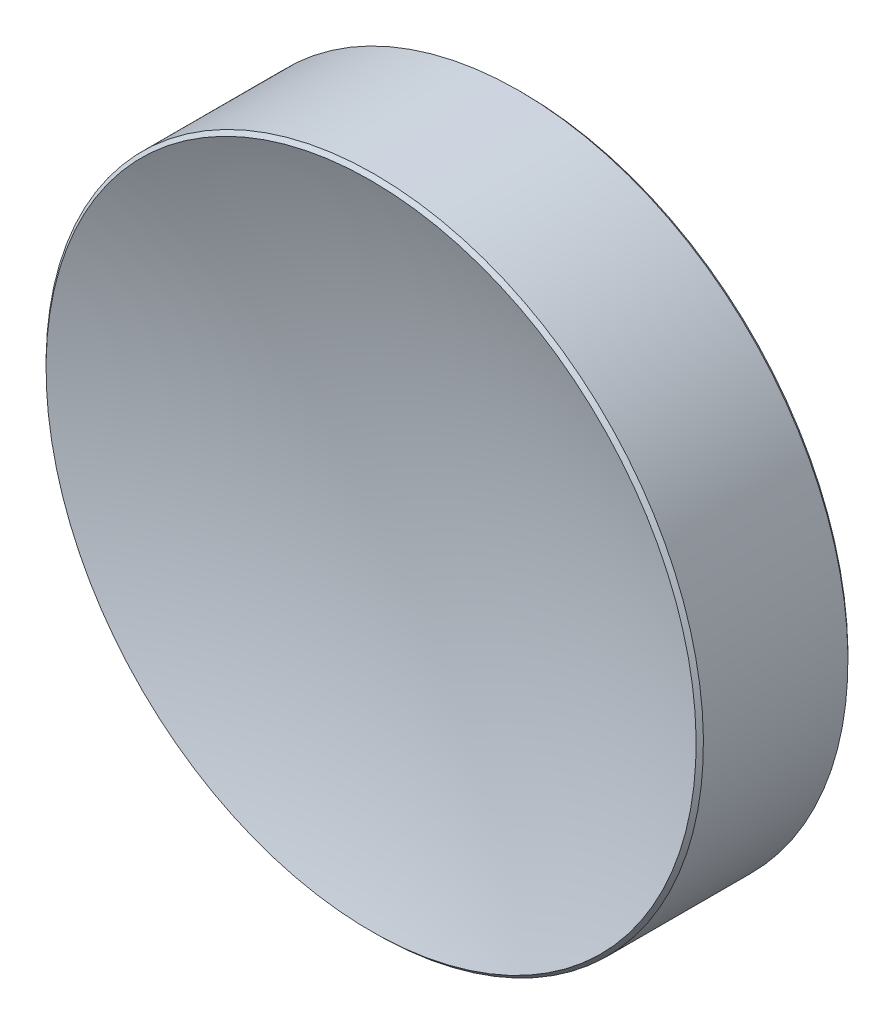
ISO-10303-21;
HEADER;
FILE_DESCRIPTION(('STEP AP214'),'2;1');
FILE_NAME('part.step','',(''),(''),'','','');
FILE_SCHEMA(('AUTOMOTIVE_DESIGN { 1 0 10303 214 1 1 1 1 }'));
ENDSEC;
DATA;
#1=APPLICATION_CONTEXT('core data for automotive mechanical design processes');
#2=APPLICATION_PROTOCOL_DEFINITION('international standard','automotive_design',2000,#1);
#3=PRODUCT_CONTEXT('',#1,'mechanical');
#4=PRODUCT('Part','Part','',(#3));
#5=PRODUCT_RELATED_PRODUCT_CATEGORY('part','',(#4));
#6=PRODUCT_DEFINITION_FORMATION('','',#4);
#7=PRODUCT_DEFINITION_CONTEXT('part definition',#1,'design');
#8=PRODUCT_DEFINITION('design','',#6,#7);
#9=PRODUCT_DEFINITION_SHAPE('','',#8);
#10=(LENGTH_UNIT() NAMED_UNIT(*) SI_UNIT(.MILLI.,.METRE.));
#11=(NAMED_UNIT(*) PLANE_ANGLE_UNIT() SI_UNIT($,.RADIAN.));
#12=(NAMED_UNIT(*) SI_UNIT($,.STERADIAN.) SOLID_ANGLE_UNIT());
#13=UNCERTAINTY_MEASURE_WITH_UNIT(LENGTH_MEASURE(1.E-05),#10,'distance_accuracy_value','');
#14=(GEOMETRIC_REPRESENTATION_CONTEXT(3) GLOBAL_UNCERTAINTY_ASSIGNED_CONTEXT((#13)) GLOBAL_UNIT_ASSIGNED_CONTEXT((#10,
#11,#12)) REPRESENTATION_CONTEXT('',''));
#15=CARTESIAN_POINT('',(0.,0.,0.));
#16=DIRECTION('',(0.,0.,1.));
#17=DIRECTION('',(1.,0.,0.));
#18=AXIS2_PLACEMENT_3D('',#15,#16,#17);
#19=CARTESIAN_POINT('',(0.,0.,36.25));
#20=DIRECTION('',(0.,0.,-1.));
#21=DIRECTION('',(0.,1.,0.));
#22=AXIS2_PLACEMENT_3D('',#19,#20,#21);
#23=SPHERICAL_SURFACE('',#22,34.5);
#24=CARTESIAN_POINT('',(0.,0.,4.11696244597427));
#25=DIRECTION('',(0.,0.,-1.));
#26=DIRECTION('',(0.,1.,0.));
#27=AXIS2_PLACEMENT_3D('',#24,#25,#26);
#28=CIRCLE('',#27,12.5585786437627);
#29=CARTESIAN_POINT('',(0.,12.5585786437627,4.11696244597428));
#30=VERTEX_POINT('',#29);
#31=EDGE_CURVE('E9',#30,#30,#28,.T.);
#32=ORIENTED_EDGE('',*,*,#31,.F.);
#33=EDGE_LOOP('',(#32));
#34=FACE_BOUND('',#33,.T.);
#35=ADVANCED_FACE('F13',(#34),#23,.F.);
#36=CARTESIAN_POINT('',(0.,0.,3.97554108973696));
#37=DIRECTION('',(0.,0.,-1.));
#38=DIRECTION('',(0.,1.,0.));
#39=AXIS2_PLACEMENT_3D('',#36,#37,#38);
#40=CONICAL_SURFACE('',#39,12.7,0.785398163397439);
#41=ORIENTED_EDGE('',*,*,#31,.T.);
#42=EDGE_LOOP('',(#41));
#43=FACE_BOUND('',#42,.T.);
#44=CARTESIAN_POINT('',(0.,0.,3.97554108973696));
#45=DIRECTION('',(0.,0.,-1.));
#46=DIRECTION('',(0.,1.,0.));
#47=AXIS2_PLACEMENT_3D('',#44,#45,#46);
#48=CIRCLE('',#47,12.7);
#49=CARTESIAN_POINT('',(0.,12.7,3.97554108973696));
#50=VERTEX_POINT('',#49);
#51=EDGE_CURVE('E19',#50,#50,#48,.T.);
#52=ORIENTED_EDGE('',*,*,#51,.F.);
#53=EDGE_LOOP('',(#52));
#54=FACE_BOUND('',#53,.T.);
#55=ADVANCED_FACE('F47',(#43,#54),#40,.T.);
#56=CARTESIAN_POINT('',(0.,0.,-1.75));
#57=DIRECTION('',(0.,0.,-1.));
#58=DIRECTION('',(0.,1.,0.));
#59=AXIS2_PLACEMENT_3D('',#56,#57,#58);
#60=CYLINDRICAL_SURFACE('',#59,12.7);
#61=ORIENTED_EDGE('',*,*,#51,.T.);
#62=EDGE_LOOP('',(#61));
#63=FACE_BOUND('',#62,.T.);
#64=CARTESIAN_POINT('',(0.,0.,-1.60857864376269));
#65=DIRECTION('',(0.,0.,-1.));
#66=DIRECTION('',(0.,1.,0.));
#67=AXIS2_PLACEMENT_3D('',#64,#65,#66);
#68=CIRCLE('',#67,12.7);
#69=CARTESIAN_POINT('',(0.,12.7,-1.60857864376269));
#70=VERTEX_POINT('',#69);
#71=EDGE_CURVE('E23',#70,#70,#68,.T.);
#72=ORIENTED_EDGE('',*,*,#71,.F.);
#73=EDGE_LOOP('',(#72));
#74=FACE_BOUND('',#73,.T.);
#75=ADVANCED_FACE('F37',(#63,#74),#60,.T.);
#76=CARTESIAN_POINT('',(0.,0.,-1.75));
#77=DIRECTION('',(0.,0.,1.));
#78=DIRECTION('',(0.,-1.,0.));
#79=AXIS2_PLACEMENT_3D('',#76,#77,#78);
#80=CONICAL_SURFACE('',#79,12.5585786437627,0.78539816339745);
#81=ORIENTED_EDGE('',*,*,#71,.T.);
#82=EDGE_LOOP('',(#81));
#83=FACE_BOUND('',#82,.T.);
#84=CARTESIAN_POINT('',(0.,0.,-1.75));
#85=DIRECTION('',(0.,0.,-1.));
#86=DIRECTION('',(0.,1.,0.));
#87=AXIS2_PLACEMENT_3D('',#84,#85,#86);
#88=CIRCLE('',#87,12.5585786437627);
#89=CARTESIAN_POINT('',(0.,12.5585786437627,-1.75));
#90=VERTEX_POINT('',#89);
#91=EDGE_CURVE('E27',#90,#90,#88,.T.);
#92=ORIENTED_EDGE('',*,*,#91,.F.);
#93=EDGE_LOOP('',(#92));
#94=FACE_BOUND('',#93,.T.);
#95=ADVANCED_FACE('F35',(#83,#94),#80,.T.);
#96=CARTESIAN_POINT('',(0.,0.,-1.75));
#97=DIRECTION('',(0.,0.,-1.));
#98=DIRECTION('',(0.,1.,0.));
#99=AXIS2_PLACEMENT_3D('',#96,#97,#98);
#100=PLANE('',#99);
#101=ORIENTED_EDGE('',*,*,#91,.T.);
#102=EDGE_LOOP('',(#101));
#103=FACE_BOUND('',#102,.T.);
#104=ADVANCED_FACE('F33',(#103),#100,.T.);
#105=CLOSED_SHELL('',(#35,#55,#75,#95,#104));
#106=MANIFOLD_SOLID_BREP('B1',#105);
#107=ADVANCED_BREP_SHAPE_REPRESENTATION('',(#18,#106),#14);
#108=SHAPE_DEFINITION_REPRESENTATION(#9,#107);
ENDSEC;
END-ISO-10303-21;
